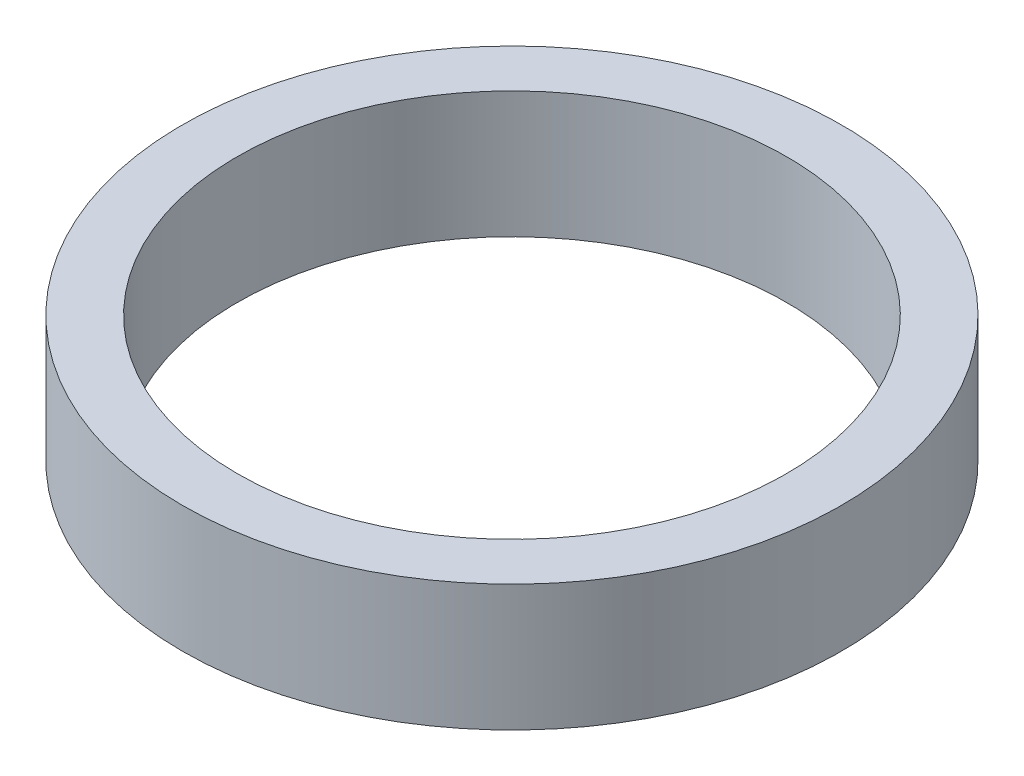
ISO-10303-21;
HEADER;
FILE_DESCRIPTION(('STEP AP214'),'2;1');
FILE_NAME('part.step','',(''),(''),'','','');
FILE_SCHEMA(('AUTOMOTIVE_DESIGN { 1 0 10303 214 1 1 1 1 }'));
ENDSEC;
DATA;
#1=APPLICATION_CONTEXT('core data for automotive mechanical design processes');
#2=APPLICATION_PROTOCOL_DEFINITION('international standard','automotive_design',2000,#1);
#3=PRODUCT_CONTEXT('',#1,'mechanical');
#4=PRODUCT('Part','Part','',(#3));
#5=PRODUCT_RELATED_PRODUCT_CATEGORY('part','',(#4));
#6=PRODUCT_DEFINITION_FORMATION('','',#4);
#7=PRODUCT_DEFINITION_CONTEXT('part definition',#1,'design');
#8=PRODUCT_DEFINITION('design','',#6,#7);
#9=PRODUCT_DEFINITION_SHAPE('','',#8);
#10=(LENGTH_UNIT() NAMED_UNIT(*) SI_UNIT(.MILLI.,.METRE.));
#11=(NAMED_UNIT(*) PLANE_ANGLE_UNIT() SI_UNIT($,.RADIAN.));
#12=(NAMED_UNIT(*) SI_UNIT($,.STERADIAN.) SOLID_ANGLE_UNIT());
#13=UNCERTAINTY_MEASURE_WITH_UNIT(LENGTH_MEASURE(1.E-05),#10,'distance_accuracy_value','');
#14=(GEOMETRIC_REPRESENTATION_CONTEXT(3) GLOBAL_UNCERTAINTY_ASSIGNED_CONTEXT((#13)) GLOBAL_UNIT_ASSIGNED_CONTEXT((#10,
#11,#12)) REPRESENTATION_CONTEXT('',''));
#15=CARTESIAN_POINT('',(0.,0.,0.));
#16=DIRECTION('',(0.,0.,1.));
#17=DIRECTION('',(1.,0.,0.));
#18=AXIS2_PLACEMENT_3D('',#15,#16,#17);
#19=CARTESIAN_POINT('',(0.,23.,0.));
#20=DIRECTION('',(0.,-1.,0.));
#21=DIRECTION('',(0.,0.,-1.));
#22=AXIS2_PLACEMENT_3D('',#19,#20,#21);
#23=CYLINDRICAL_SURFACE('',#22,60.);
#24=CARTESIAN_POINT('',(0.,23.,0.));
#25=DIRECTION('',(0.,1.,0.));
#26=DIRECTION('',(0.,0.,1.));
#27=AXIS2_PLACEMENT_3D('',#24,#25,#26);
#28=CIRCLE('',#27,60.);
#29=CARTESIAN_POINT('',(0.,23.,60.));
#30=VERTEX_POINT('',#29);
#31=EDGE_CURVE('E10',#30,#30,#28,.T.);
#32=ORIENTED_EDGE('',*,*,#31,.F.);
#33=EDGE_LOOP('',(#32));
#34=FACE_BOUND('',#33,.T.);
#35=CARTESIAN_POINT('',(0.,0.,0.));
#36=DIRECTION('',(0.,1.,0.));
#37=DIRECTION('',(0.,0.,1.));
#38=AXIS2_PLACEMENT_3D('',#35,#36,#37);
#39=CIRCLE('',#38,60.);
#40=CARTESIAN_POINT('',(0.,0.,60.));
#41=VERTEX_POINT('',#40);
#42=EDGE_CURVE('E37',#41,#41,#39,.T.);
#43=ORIENTED_EDGE('',*,*,#42,.T.);
#44=EDGE_LOOP('',(#43));
#45=FACE_BOUND('',#44,.T.);
#46=ADVANCED_FACE('F40',(#34,#45),#23,.T.);
#47=CARTESIAN_POINT('',(0.,23.,0.));
#48=DIRECTION('',(0.,1.,0.));
#49=DIRECTION('',(0.,0.,1.));
#50=AXIS2_PLACEMENT_3D('',#47,#48,#49);
#51=PLANE('',#50);
#52=CARTESIAN_POINT('',(0.,23.,0.));
#53=DIRECTION('',(0.,1.,0.));
#54=DIRECTION('',(0.,0.,1.));
#55=AXIS2_PLACEMENT_3D('',#52,#53,#54);
#56=CIRCLE('',#55,50.);
#57=CARTESIAN_POINT('',(0.,23.,50.));
#58=VERTEX_POINT('',#57);
#59=EDGE_CURVE('E50',#58,#58,#56,.T.);
#60=ORIENTED_EDGE('',*,*,#59,.F.);
#61=EDGE_LOOP('',(#60));
#62=FACE_BOUND('',#61,.T.);
#63=ORIENTED_EDGE('',*,*,#31,.T.);
#64=EDGE_LOOP('',(#63));
#65=FACE_BOUND('',#64,.T.);
#66=ADVANCED_FACE('F59',(#62,#65),#51,.T.);
#67=CARTESIAN_POINT('',(0.,0.,0.));
#68=DIRECTION('',(0.,1.,0.));
#69=DIRECTION('',(0.,0.,1.));
#70=AXIS2_PLACEMENT_3D('',#67,#68,#69);
#71=PLANE('',#70);
#72=CARTESIAN_POINT('',(0.,0.,0.));
#73=DIRECTION('',(0.,1.,0.));
#74=DIRECTION('',(0.,0.,1.));
#75=AXIS2_PLACEMENT_3D('',#72,#73,#74);
#76=CIRCLE('',#75,50.);
#77=CARTESIAN_POINT('',(0.,0.,50.));
#78=VERTEX_POINT('',#77);
#79=EDGE_CURVE('E47',#78,#78,#76,.T.);
#80=ORIENTED_EDGE('',*,*,#79,.T.);
#81=EDGE_LOOP('',(#80));
#82=FACE_BOUND('',#81,.T.);
#83=ORIENTED_EDGE('',*,*,#42,.F.);
#84=EDGE_LOOP('',(#83));
#85=FACE_BOUND('',#84,.T.);
#86=ADVANCED_FACE('F58',(#82,#85),#71,.F.);
#87=CARTESIAN_POINT('',(0.,23.,0.));
#88=DIRECTION('',(0.,-1.,0.));
#89=DIRECTION('',(0.,0.,-1.));
#90=AXIS2_PLACEMENT_3D('',#87,#88,#89);
#91=CYLINDRICAL_SURFACE('',#90,50.);
#92=ORIENTED_EDGE('',*,*,#59,.T.);
#93=EDGE_LOOP('',(#92));
#94=FACE_BOUND('',#93,.T.);
#95=ORIENTED_EDGE('',*,*,#79,.F.);
#96=EDGE_LOOP('',(#95));
#97=FACE_BOUND('',#96,.T.);
#98=ADVANCED_FACE('F54',(#94,#97),#91,.F.);
#99=CLOSED_SHELL('',(#46,#66,#86,#98));
#100=MANIFOLD_SOLID_BREP('B2',#99);
#101=ADVANCED_BREP_SHAPE_REPRESENTATION('',(#18,#100),#14);
#102=SHAPE_DEFINITION_REPRESENTATION(#9,#101);
ENDSEC;
END-ISO-10303-21;
